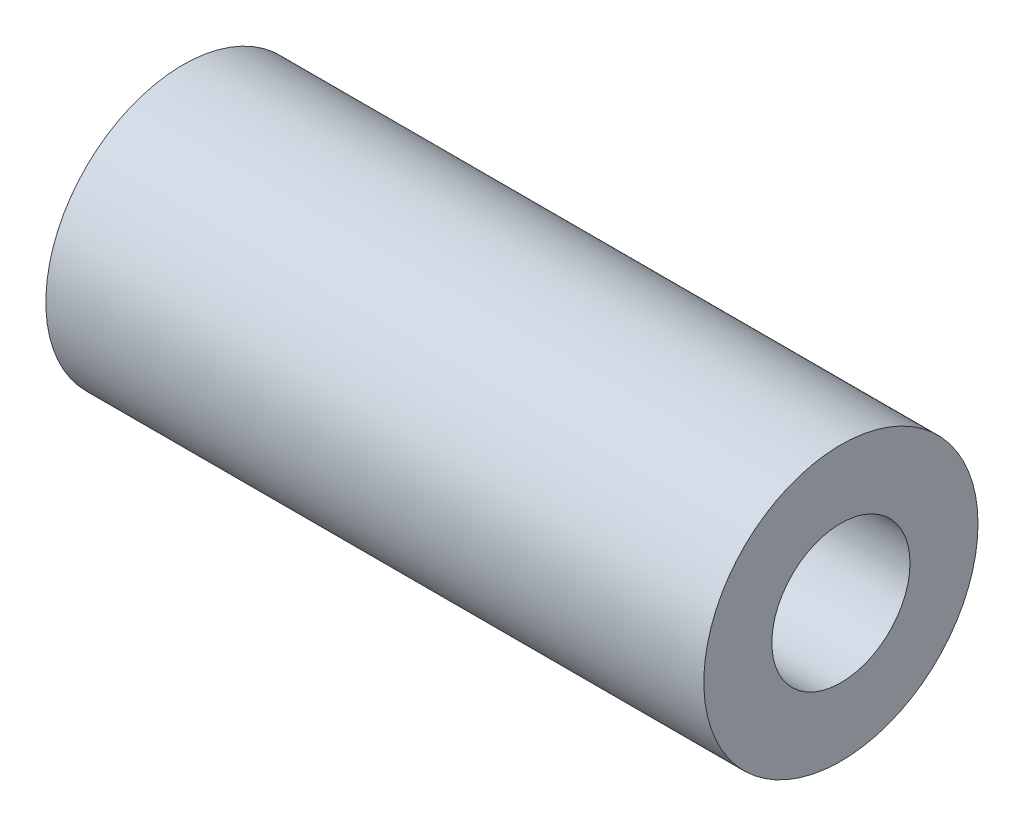
ISO-10303-21;
HEADER;
FILE_DESCRIPTION(('STEP AP214'),'2;1');
FILE_NAME('part.step','',(''),(''),'','','');
FILE_SCHEMA(('AUTOMOTIVE_DESIGN { 1 0 10303 214 1 1 1 1 }'));
ENDSEC;
DATA;
#1=APPLICATION_CONTEXT('core data for automotive mechanical design processes');
#2=APPLICATION_PROTOCOL_DEFINITION('international standard','automotive_design',2000,#1);
#3=PRODUCT_CONTEXT('',#1,'mechanical');
#4=PRODUCT('Part','Part','',(#3));
#5=PRODUCT_RELATED_PRODUCT_CATEGORY('part','',(#4));
#6=PRODUCT_DEFINITION_FORMATION('','',#4);
#7=PRODUCT_DEFINITION_CONTEXT('part definition',#1,'design');
#8=PRODUCT_DEFINITION('design','',#6,#7);
#9=PRODUCT_DEFINITION_SHAPE('','',#8);
#10=(LENGTH_UNIT() NAMED_UNIT(*) SI_UNIT(.MILLI.,.METRE.));
#11=(NAMED_UNIT(*) PLANE_ANGLE_UNIT() SI_UNIT($,.RADIAN.));
#12=(NAMED_UNIT(*) SI_UNIT($,.STERADIAN.) SOLID_ANGLE_UNIT());
#13=UNCERTAINTY_MEASURE_WITH_UNIT(LENGTH_MEASURE(1.E-05),#10,'distance_accuracy_value','');
#14=(GEOMETRIC_REPRESENTATION_CONTEXT(3) GLOBAL_UNCERTAINTY_ASSIGNED_CONTEXT((#13)) GLOBAL_UNIT_ASSIGNED_CONTEXT((#10,
#11,#12)) REPRESENTATION_CONTEXT('',''));
#15=CARTESIAN_POINT('',(0.,0.,0.));
#16=DIRECTION('',(0.,0.,1.));
#17=DIRECTION('',(1.,0.,0.));
#18=AXIS2_PLACEMENT_3D('',#15,#16,#17);
#19=CARTESIAN_POINT('',(30.48,0.,0.));
#20=DIRECTION('',(1.,0.,0.));
#21=DIRECTION('',(0.,0.,-1.));
#22=AXIS2_PLACEMENT_3D('',#19,#20,#21);
#23=PLANE('',#22);
#24=CARTESIAN_POINT('',(30.48,0.,0.));
#25=DIRECTION('',(1.,0.,0.));
#26=DIRECTION('',(0.,0.,-1.));
#27=AXIS2_PLACEMENT_3D('',#24,#25,#26);
#28=CIRCLE('',#27,6.35);
#29=CARTESIAN_POINT('',(30.48,0.,-6.35));
#30=VERTEX_POINT('',#29);
#31=EDGE_CURVE('E10',#30,#30,#28,.T.);
#32=ORIENTED_EDGE('',*,*,#31,.T.);
#33=EDGE_LOOP('',(#32));
#34=FACE_BOUND('',#33,.T.);
#35=CARTESIAN_POINT('',(30.48,0.,0.));
#36=DIRECTION('',(1.,0.,0.));
#37=DIRECTION('',(0.,0.,-1.));
#38=AXIS2_PLACEMENT_3D('',#35,#36,#37);
#39=CIRCLE('',#38,3.2004);
#40=CARTESIAN_POINT('',(30.48,0.,-3.2004));
#41=VERTEX_POINT('',#40);
#42=EDGE_CURVE('E49',#41,#41,#39,.T.);
#43=ORIENTED_EDGE('',*,*,#42,.F.);
#44=EDGE_LOOP('',(#43));
#45=FACE_BOUND('',#44,.T.);
#46=ADVANCED_FACE('F35',(#34,#45),#23,.T.);
#47=CARTESIAN_POINT('',(0.,0.,0.));
#48=DIRECTION('',(1.,0.,0.));
#49=DIRECTION('',(0.,0.,-1.));
#50=AXIS2_PLACEMENT_3D('',#47,#48,#49);
#51=PLANE('',#50);
#52=CARTESIAN_POINT('',(0.,0.,0.));
#53=DIRECTION('',(1.,0.,0.));
#54=DIRECTION('',(0.,0.,-1.));
#55=AXIS2_PLACEMENT_3D('',#52,#53,#54);
#56=CIRCLE('',#55,6.35);
#57=CARTESIAN_POINT('',(0.,0.,-6.35));
#58=VERTEX_POINT('',#57);
#59=EDGE_CURVE('E39',#58,#58,#56,.T.);
#60=ORIENTED_EDGE('',*,*,#59,.F.);
#61=EDGE_LOOP('',(#60));
#62=FACE_BOUND('',#61,.T.);
#63=CARTESIAN_POINT('',(0.,0.,0.));
#64=DIRECTION('',(1.,0.,0.));
#65=DIRECTION('',(0.,0.,-1.));
#66=AXIS2_PLACEMENT_3D('',#63,#64,#65);
#67=CIRCLE('',#66,3.2004);
#68=CARTESIAN_POINT('',(0.,0.,-3.2004));
#69=VERTEX_POINT('',#68);
#70=EDGE_CURVE('E51',#69,#69,#67,.T.);
#71=ORIENTED_EDGE('',*,*,#70,.T.);
#72=EDGE_LOOP('',(#71));
#73=FACE_BOUND('',#72,.T.);
#74=ADVANCED_FACE('F62',(#62,#73),#51,.F.);
#75=CARTESIAN_POINT('',(30.48,0.,0.));
#76=DIRECTION('',(-1.,0.,0.));
#77=DIRECTION('',(0.,0.,1.));
#78=AXIS2_PLACEMENT_3D('',#75,#76,#77);
#79=CYLINDRICAL_SURFACE('',#78,6.35);
#80=ORIENTED_EDGE('',*,*,#31,.F.);
#81=EDGE_LOOP('',(#80));
#82=FACE_BOUND('',#81,.T.);
#83=ORIENTED_EDGE('',*,*,#59,.T.);
#84=EDGE_LOOP('',(#83));
#85=FACE_BOUND('',#84,.T.);
#86=ADVANCED_FACE('F37',(#82,#85),#79,.T.);
#87=CARTESIAN_POINT('',(30.48,0.,0.));
#88=DIRECTION('',(-1.,0.,0.));
#89=DIRECTION('',(0.,0.,1.));
#90=AXIS2_PLACEMENT_3D('',#87,#88,#89);
#91=CYLINDRICAL_SURFACE('',#90,3.2004);
#92=ORIENTED_EDGE('',*,*,#42,.T.);
#93=EDGE_LOOP('',(#92));
#94=FACE_BOUND('',#93,.T.);
#95=ORIENTED_EDGE('',*,*,#70,.F.);
#96=EDGE_LOOP('',(#95));
#97=FACE_BOUND('',#96,.T.);
#98=ADVANCED_FACE('F58',(#94,#97),#91,.F.);
#99=CLOSED_SHELL('',(#46,#74,#86,#98));
#100=MANIFOLD_SOLID_BREP('B2',#99);
#101=ADVANCED_BREP_SHAPE_REPRESENTATION('',(#18,#100),#14);
#102=SHAPE_DEFINITION_REPRESENTATION(#9,#101);
ENDSEC;
END-ISO-10303-21;
